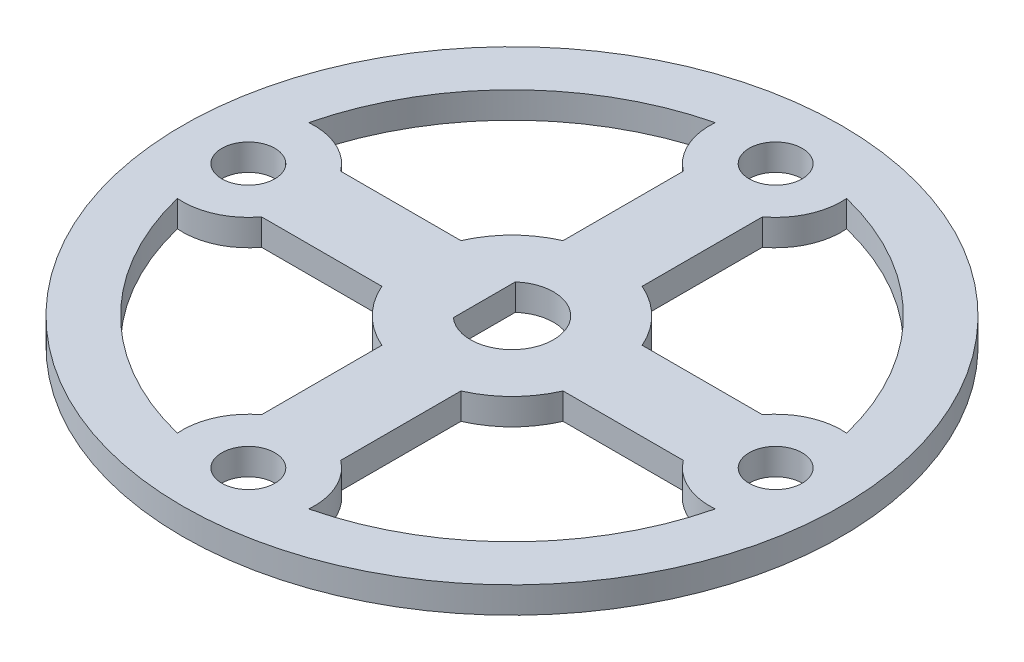
ISO-10303-21;
HEADER;
FILE_DESCRIPTION(('STEP AP214'),'2;1');
FILE_NAME('part.step','',(''),(''),'','','');
FILE_SCHEMA(('AUTOMOTIVE_DESIGN { 1 0 10303 214 1 1 1 1 }'));
ENDSEC;
DATA;
#1=APPLICATION_CONTEXT('core data for automotive mechanical design processes');
#2=APPLICATION_PROTOCOL_DEFINITION('international standard','automotive_design',2000,#1);
#3=PRODUCT_CONTEXT('',#1,'mechanical');
#4=PRODUCT('Part','Part','',(#3));
#5=PRODUCT_RELATED_PRODUCT_CATEGORY('part','',(#4));
#6=PRODUCT_DEFINITION_FORMATION('','',#4);
#7=PRODUCT_DEFINITION_CONTEXT('part definition',#1,'design');
#8=PRODUCT_DEFINITION('design','',#6,#7);
#9=PRODUCT_DEFINITION_SHAPE('','',#8);
#10=(LENGTH_UNIT() NAMED_UNIT(*) SI_UNIT(.MILLI.,.METRE.));
#11=(NAMED_UNIT(*) PLANE_ANGLE_UNIT() SI_UNIT($,.RADIAN.));
#12=(NAMED_UNIT(*) SI_UNIT($,.STERADIAN.) SOLID_ANGLE_UNIT());
#13=UNCERTAINTY_MEASURE_WITH_UNIT(LENGTH_MEASURE(1.E-05),#10,'distance_accuracy_value','');
#14=(GEOMETRIC_REPRESENTATION_CONTEXT(3) GLOBAL_UNCERTAINTY_ASSIGNED_CONTEXT((#13)) GLOBAL_UNIT_ASSIGNED_CONTEXT((#10,
#11,#12)) REPRESENTATION_CONTEXT('',''));
#15=CARTESIAN_POINT('',(0.,0.,0.));
#16=DIRECTION('',(0.,0.,1.));
#17=DIRECTION('',(1.,0.,0.));
#18=AXIS2_PLACEMENT_3D('',#15,#16,#17);
#19=CARTESIAN_POINT('',(0.,1.27,0.));
#20=DIRECTION('',(0.,1.,0.));
#21=DIRECTION('',(0.,0.,1.));
#22=AXIS2_PLACEMENT_3D('',#19,#20,#21);
#23=PLANE('',#22);
#24=CARTESIAN_POINT('',(-25.4,1.27,0.));
#25=DIRECTION('',(0.,-1.,0.));
#26=DIRECTION('',(-1.,0.,0.));
#27=AXIS2_PLACEMENT_3D('',#24,#25,#26);
#28=CIRCLE('',#27,6.35);
#29=CARTESIAN_POINT('',(-25.908,1.27,-6.32964738354348));
#30=VERTEX_POINT('',#29);
#31=CARTESIAN_POINT('',(-20.32,1.27,-3.80999999999993));
#32=VERTEX_POINT('',#31);
#33=EDGE_CURVE('E51',#30,#32,#28,.T.);
#34=ORIENTED_EDGE('',*,*,#33,.F.);
#35=CARTESIAN_POINT('',(0.,1.27,0.));
#36=DIRECTION('',(0.,1.,0.));
#37=DIRECTION('',(-1.,0.,0.));
#38=AXIS2_PLACEMENT_3D('',#35,#36,#37);
#39=CIRCLE('',#38,26.67);
#40=CARTESIAN_POINT('',(-6.32964738354366,1.27,-25.908));
#41=VERTEX_POINT('',#40);
#42=EDGE_CURVE('E231',#41,#30,#39,.T.);
#43=ORIENTED_EDGE('',*,*,#42,.F.);
#44=CARTESIAN_POINT('',(0.,1.27,-25.4));
#45=DIRECTION('',(0.,-1.,0.));
#46=DIRECTION('',(1.,0.,0.));
#47=AXIS2_PLACEMENT_3D('',#44,#45,#46);
#48=CIRCLE('',#47,6.35);
#49=CARTESIAN_POINT('',(-3.81000000000007,1.27,-20.32));
#50=VERTEX_POINT('',#49);
#51=EDGE_CURVE('E234',#50,#41,#48,.T.);
#52=ORIENTED_EDGE('',*,*,#51,.F.);
#53=DIRECTION('',(0.,0.,-1.));
#54=VECTOR('',#53,1.);
#55=CARTESIAN_POINT('',(-3.81000000000003,1.27,-8.72980669889086));
#56=LINE('',#55,#54);
#57=CARTESIAN_POINT('',(-3.81000000000003,1.27,-8.72980669889086));
#58=VERTEX_POINT('',#57);
#59=EDGE_CURVE('E251',#58,#50,#56,.T.);
#60=ORIENTED_EDGE('',*,*,#59,.F.);
#61=CARTESIAN_POINT('',(0.,1.27,0.));
#62=DIRECTION('',(0.,-1.,0.));
#63=DIRECTION('',(-1.,0.,0.));
#64=AXIS2_PLACEMENT_3D('',#61,#62,#63);
#65=CIRCLE('',#64,9.525);
#66=CARTESIAN_POINT('',(-8.72980669889089,1.27,-3.80999999999997));
#67=VERTEX_POINT('',#66);
#68=EDGE_CURVE('E248',#67,#58,#65,.T.);
#69=ORIENTED_EDGE('',*,*,#68,.F.);
#70=DIRECTION('',(1.,0.,0.));
#71=VECTOR('',#70,1.);
#72=CARTESIAN_POINT('',(-8.72980669889089,1.27,-3.80999999999997));
#73=LINE('',#72,#71);
#74=EDGE_CURVE('E245',#32,#67,#73,.T.);
#75=ORIENTED_EDGE('',*,*,#74,.F.);
#76=EDGE_LOOP('',(#34,#43,#52,#60,#69,#75));
#77=FACE_BOUND('',#76,.T.);
#78=CARTESIAN_POINT('',(0.,1.27,25.4));
#79=DIRECTION('',(0.,-1.,0.));
#80=DIRECTION('',(0.,0.,1.));
#81=AXIS2_PLACEMENT_3D('',#78,#79,#80);
#82=CIRCLE('',#81,6.35);
#83=CARTESIAN_POINT('',(-6.32964738354357,1.27,25.908));
#84=VERTEX_POINT('',#83);
#85=CARTESIAN_POINT('',(-3.81,1.27,20.32));
#86=VERTEX_POINT('',#85);
#87=EDGE_CURVE('E59',#84,#86,#82,.T.);
#88=ORIENTED_EDGE('',*,*,#87,.F.);
#89=CARTESIAN_POINT('',(0.,1.27,0.));
#90=DIRECTION('',(0.,1.,0.));
#91=DIRECTION('',(0.,0.,1.));
#92=AXIS2_PLACEMENT_3D('',#89,#90,#91);
#93=CIRCLE('',#92,26.67);
#94=CARTESIAN_POINT('',(-25.908,1.27,6.32964738354357));
#95=VERTEX_POINT('',#94);
#96=EDGE_CURVE('E270',#95,#84,#93,.T.);
#97=ORIENTED_EDGE('',*,*,#96,.F.);
#98=CARTESIAN_POINT('',(-25.4,1.27,0.));
#99=DIRECTION('',(0.,-1.,0.));
#100=DIRECTION('',(0.,0.,-1.));
#101=AXIS2_PLACEMENT_3D('',#98,#99,#100);
#102=CIRCLE('',#101,6.35);
#103=CARTESIAN_POINT('',(-20.32,1.27,3.81));
#104=VERTEX_POINT('',#103);
#105=EDGE_CURVE('E297',#104,#95,#102,.T.);
#106=ORIENTED_EDGE('',*,*,#105,.F.);
#107=DIRECTION('',(-1.,0.,0.));
#108=VECTOR('',#107,1.);
#109=CARTESIAN_POINT('',(-8.72980669889088,1.27,3.81));
#110=LINE('',#109,#108);
#111=CARTESIAN_POINT('',(-8.72980669889088,1.27,3.81));
#112=VERTEX_POINT('',#111);
#113=EDGE_CURVE('E294',#112,#104,#110,.T.);
#114=ORIENTED_EDGE('',*,*,#113,.F.);
#115=CARTESIAN_POINT('',(0.,1.27,0.));
#116=DIRECTION('',(0.,-1.,0.));
#117=DIRECTION('',(0.,0.,1.));
#118=AXIS2_PLACEMENT_3D('',#115,#116,#117);
#119=CIRCLE('',#118,9.525);
#120=CARTESIAN_POINT('',(-3.81,1.27,8.72980669889088));
#121=VERTEX_POINT('',#120);
#122=EDGE_CURVE('E291',#121,#112,#119,.T.);
#123=ORIENTED_EDGE('',*,*,#122,.F.);
#124=DIRECTION('',(0.,0.,-1.));
#125=VECTOR('',#124,1.);
#126=CARTESIAN_POINT('',(-3.81,1.27,8.72980669889088));
#127=LINE('',#126,#125);
#128=EDGE_CURVE('E287',#86,#121,#127,.T.);
#129=ORIENTED_EDGE('',*,*,#128,.F.);
#130=EDGE_LOOP('',(#88,#97,#106,#114,#123,#129));
#131=FACE_BOUND('',#130,.T.);
#132=CARTESIAN_POINT('',(25.4,1.27,-2.66050878019847E-13));
#133=DIRECTION('',(0.,-1.,0.));
#134=DIRECTION('',(1.,0.,0.));
#135=AXIS2_PLACEMENT_3D('',#132,#133,#134);
#136=CIRCLE('',#135,6.35);
#137=CARTESIAN_POINT('',(25.9080000000001,1.27,6.3296473835433));
#138=VERTEX_POINT('',#137);
#139=CARTESIAN_POINT('',(20.32,1.27,3.80999999999979));
#140=VERTEX_POINT('',#139);
#141=EDGE_CURVE('E332',#138,#140,#136,.T.);
#142=ORIENTED_EDGE('',*,*,#141,.F.);
#143=CARTESIAN_POINT('',(0.,1.27,0.));
#144=DIRECTION('',(0.,1.,0.));
#145=DIRECTION('',(1.,0.,0.));
#146=AXIS2_PLACEMENT_3D('',#143,#144,#145);
#147=CIRCLE('',#146,26.67);
#148=CARTESIAN_POINT('',(6.32964738354385,1.27,25.9079999999999));
#149=VERTEX_POINT('',#148);
#150=EDGE_CURVE('E316',#149,#138,#147,.T.);
#151=ORIENTED_EDGE('',*,*,#150,.F.);
#152=CARTESIAN_POINT('',(2.66050878019847E-13,1.27,25.4));
#153=DIRECTION('',(0.,-1.,0.));
#154=DIRECTION('',(-1.,0.,0.));
#155=AXIS2_PLACEMENT_3D('',#152,#153,#154);
#156=CIRCLE('',#155,6.35);
#157=CARTESIAN_POINT('',(3.81000000000021,1.27,20.32));
#158=VERTEX_POINT('',#157);
#159=EDGE_CURVE('E343',#158,#149,#156,.T.);
#160=ORIENTED_EDGE('',*,*,#159,.F.);
#161=DIRECTION('',(0.,0.,1.));
#162=VECTOR('',#161,1.);
#163=CARTESIAN_POINT('',(3.81000000000009,1.27,8.72980669889083));
#164=LINE('',#163,#162);
#165=CARTESIAN_POINT('',(3.81000000000009,1.27,8.72980669889083));
#166=VERTEX_POINT('',#165);
#167=EDGE_CURVE('E340',#166,#158,#164,.T.);
#168=ORIENTED_EDGE('',*,*,#167,.F.);
#169=CARTESIAN_POINT('',(0.,1.27,0.));
#170=DIRECTION('',(0.,-1.,0.));
#171=DIRECTION('',(1.,0.,0.));
#172=AXIS2_PLACEMENT_3D('',#169,#170,#171);
#173=CIRCLE('',#172,9.525);
#174=CARTESIAN_POINT('',(8.72980669889091,1.27,3.80999999999991));
#175=VERTEX_POINT('',#174);
#176=EDGE_CURVE('E337',#175,#166,#173,.T.);
#177=ORIENTED_EDGE('',*,*,#176,.F.);
#178=DIRECTION('',(-1.,0.,0.));
#179=VECTOR('',#178,1.);
#180=CARTESIAN_POINT('',(8.72980669889091,1.27,3.80999999999991));
#181=LINE('',#180,#179);
#182=EDGE_CURVE('E334',#140,#175,#181,.T.);
#183=ORIENTED_EDGE('',*,*,#182,.F.);
#184=EDGE_LOOP('',(#142,#151,#160,#168,#177,#183));
#185=FACE_BOUND('',#184,.T.);
#186=CARTESIAN_POINT('',(-25.4,1.27,0.));
#187=DIRECTION('',(0.,1.,0.));
#188=DIRECTION('',(1.,0.,0.));
#189=AXIS2_PLACEMENT_3D('',#186,#187,#188);
#190=CIRCLE('',#189,2.5527);
#191=CARTESIAN_POINT('',(-22.8473,1.27,0.));
#192=VERTEX_POINT('',#191);
#193=EDGE_CURVE('E363',#192,#192,#190,.T.);
#194=ORIENTED_EDGE('',*,*,#193,.F.);
#195=EDGE_LOOP('',(#194));
#196=FACE_BOUND('',#195,.T.);
#197=CARTESIAN_POINT('',(0.,1.27,25.4));
#198=DIRECTION('',(0.,1.,0.));
#199=DIRECTION('',(0.,0.,-1.));
#200=AXIS2_PLACEMENT_3D('',#197,#198,#199);
#201=CIRCLE('',#200,2.5527);
#202=CARTESIAN_POINT('',(0.,1.27,22.8473));
#203=VERTEX_POINT('',#202);
#204=EDGE_CURVE('E369',#203,#203,#201,.T.);
#205=ORIENTED_EDGE('',*,*,#204,.F.);
#206=EDGE_LOOP('',(#205));
#207=FACE_BOUND('',#206,.T.);
#208=CARTESIAN_POINT('',(25.4,1.27,-2.66050878019847E-13));
#209=DIRECTION('',(0.,1.,0.));
#210=DIRECTION('',(-1.,0.,0.));
#211=AXIS2_PLACEMENT_3D('',#208,#209,#210);
#212=CIRCLE('',#211,2.5527);
#213=CARTESIAN_POINT('',(22.8473,1.27,-2.39312764778852E-13));
#214=VERTEX_POINT('',#213);
#215=EDGE_CURVE('E258',#214,#214,#212,.T.);
#216=ORIENTED_EDGE('',*,*,#215,.F.);
#217=EDGE_LOOP('',(#216));
#218=FACE_BOUND('',#217,.T.);
#219=CARTESIAN_POINT('',(0.,1.27,-25.4));
#220=DIRECTION('',(0.,-1.,0.));
#221=DIRECTION('',(0.,0.,-1.));
#222=AXIS2_PLACEMENT_3D('',#219,#220,#221);
#223=CIRCLE('',#222,6.35);
#224=CARTESIAN_POINT('',(6.32964738354357,1.27,-25.908));
#225=VERTEX_POINT('',#224);
#226=CARTESIAN_POINT('',(3.81,1.27,-20.32));
#227=VERTEX_POINT('',#226);
#228=EDGE_CURVE('E362',#225,#227,#223,.T.);
#229=ORIENTED_EDGE('',*,*,#228,.F.);
#230=CARTESIAN_POINT('',(0.,1.27,0.));
#231=DIRECTION('',(0.,1.,0.));
#232=DIRECTION('',(0.,0.,-1.));
#233=AXIS2_PLACEMENT_3D('',#230,#231,#232);
#234=CIRCLE('',#233,26.67);
#235=CARTESIAN_POINT('',(25.908,1.27,-6.32964738354357));
#236=VERTEX_POINT('',#235);
#237=EDGE_CURVE('E381',#236,#225,#234,.T.);
#238=ORIENTED_EDGE('',*,*,#237,.F.);
#239=CARTESIAN_POINT('',(25.4,1.27,0.));
#240=DIRECTION('',(0.,-1.,0.));
#241=DIRECTION('',(0.,0.,1.));
#242=AXIS2_PLACEMENT_3D('',#239,#240,#241);
#243=CIRCLE('',#242,6.35);
#244=CARTESIAN_POINT('',(20.32,1.27,-3.81));
#245=VERTEX_POINT('',#244);
#246=EDGE_CURVE('E407',#245,#236,#243,.T.);
#247=ORIENTED_EDGE('',*,*,#246,.F.);
#248=DIRECTION('',(1.,0.,0.));
#249=VECTOR('',#248,1.);
#250=CARTESIAN_POINT('',(8.72980669889088,1.27,-3.81));
#251=LINE('',#250,#249);
#252=CARTESIAN_POINT('',(8.72980669889088,1.27,-3.81));
#253=VERTEX_POINT('',#252);
#254=EDGE_CURVE('E404',#253,#245,#251,.T.);
#255=ORIENTED_EDGE('',*,*,#254,.F.);
#256=CARTESIAN_POINT('',(0.,1.27,0.));
#257=DIRECTION('',(0.,-1.,0.));
#258=DIRECTION('',(0.,0.,-1.));
#259=AXIS2_PLACEMENT_3D('',#256,#257,#258);
#260=CIRCLE('',#259,9.525);
#261=CARTESIAN_POINT('',(3.81,1.27,-8.72980669889088));
#262=VERTEX_POINT('',#261);
#263=EDGE_CURVE('E401',#262,#253,#260,.T.);
#264=ORIENTED_EDGE('',*,*,#263,.F.);
#265=DIRECTION('',(0.,0.,1.));
#266=VECTOR('',#265,1.);
#267=CARTESIAN_POINT('',(3.81,1.27,-8.72980669889088));
#268=LINE('',#267,#266);
#269=EDGE_CURVE('E398',#227,#262,#268,.T.);
#270=ORIENTED_EDGE('',*,*,#269,.F.);
#271=EDGE_LOOP('',(#229,#238,#247,#255,#264,#270));
#272=FACE_BOUND('',#271,.T.);
#273=CARTESIAN_POINT('',(0.,1.27,-25.4));
#274=DIRECTION('',(0.,1.,0.));
#275=DIRECTION('',(0.,0.,1.));
#276=AXIS2_PLACEMENT_3D('',#273,#274,#275);
#277=CIRCLE('',#276,2.5527);
#278=CARTESIAN_POINT('',(0.,1.27,-22.8473));
#279=VERTEX_POINT('',#278);
#280=EDGE_CURVE('E414',#279,#279,#277,.T.);
#281=ORIENTED_EDGE('',*,*,#280,.F.);
#282=EDGE_LOOP('',(#281));
#283=FACE_BOUND('',#282,.T.);
#284=CARTESIAN_POINT('',(0.,1.27,0.));
#285=DIRECTION('',(0.,1.,0.));
#286=DIRECTION('',(0.,0.,1.));
#287=AXIS2_PLACEMENT_3D('',#284,#285,#286);
#288=CIRCLE('',#287,31.75);
#289=CARTESIAN_POINT('',(0.,1.27,31.75));
#290=VERTEX_POINT('',#289);
#291=EDGE_CURVE('E11',#290,#290,#288,.T.);
#292=ORIENTED_EDGE('',*,*,#291,.T.);
#293=EDGE_LOOP('',(#292));
#294=FACE_BOUND('',#293,.T.);
#295=CARTESIAN_POINT('',(0.,1.27,0.));
#296=DIRECTION('',(0.,1.,0.));
#297=DIRECTION('',(0.,0.,1.));
#298=AXIS2_PLACEMENT_3D('',#295,#296,#297);
#299=CIRCLE('',#298,4.000000128);
#300=CARTESIAN_POINT('',(-2.667,1.27,2.98112596580554));
#301=VERTEX_POINT('',#300);
#302=CARTESIAN_POINT('',(-2.667,1.27,-2.98112596580554));
#303=VERTEX_POINT('',#302);
#304=EDGE_CURVE('E443',#301,#303,#299,.T.);
#305=ORIENTED_EDGE('',*,*,#304,.F.);
#306=DIRECTION('',(0.,0.,-1.));
#307=VECTOR('',#306,1.);
#308=CARTESIAN_POINT('',(-2.667,1.27,2.98112596580554));
#309=LINE('',#308,#307);
#310=EDGE_CURVE('E428',#301,#303,#309,.T.);
#311=ORIENTED_EDGE('',*,*,#310,.T.);
#312=EDGE_LOOP('',(#305,#311));
#313=FACE_BOUND('',#312,.T.);
#314=ADVANCED_FACE('F36',(#77,#131,#185,#196,#207,#218,#272,#283,#294,#313),#23,.T.);
#315=CARTESIAN_POINT('',(0.,-1.27,0.));
#316=DIRECTION('',(0.,1.,0.));
#317=DIRECTION('',(0.,0.,1.));
#318=AXIS2_PLACEMENT_3D('',#315,#316,#317);
#319=PLANE('',#318);
#320=CARTESIAN_POINT('',(0.,-1.27,0.));
#321=DIRECTION('',(0.,1.,0.));
#322=DIRECTION('',(-1.,0.,0.));
#323=AXIS2_PLACEMENT_3D('',#320,#321,#322);
#324=CIRCLE('',#323,26.67);
#325=CARTESIAN_POINT('',(-6.32964738354366,-1.27,-25.908));
#326=VERTEX_POINT('',#325);
#327=CARTESIAN_POINT('',(-25.908,-1.27,-6.32964738354348));
#328=VERTEX_POINT('',#327);
#329=EDGE_CURVE('E217',#326,#328,#324,.T.);
#330=ORIENTED_EDGE('',*,*,#329,.T.);
#331=CARTESIAN_POINT('',(-25.4,-1.27,0.));
#332=DIRECTION('',(0.,-1.,0.));
#333=DIRECTION('',(-1.,0.,0.));
#334=AXIS2_PLACEMENT_3D('',#331,#332,#333);
#335=CIRCLE('',#334,6.35);
#336=CARTESIAN_POINT('',(-20.32,-1.27,-3.80999999999993));
#337=VERTEX_POINT('',#336);
#338=EDGE_CURVE('E211',#328,#337,#335,.T.);
#339=ORIENTED_EDGE('',*,*,#338,.T.);
#340=DIRECTION('',(1.,0.,0.));
#341=VECTOR('',#340,1.);
#342=CARTESIAN_POINT('',(-8.72980669889089,-1.27,-3.80999999999997));
#343=LINE('',#342,#341);
#344=CARTESIAN_POINT('',(-8.72980669889089,-1.27,-3.80999999999997));
#345=VERTEX_POINT('',#344);
#346=EDGE_CURVE('E221',#337,#345,#343,.T.);
#347=ORIENTED_EDGE('',*,*,#346,.T.);
#348=CARTESIAN_POINT('',(0.,-1.27,0.));
#349=DIRECTION('',(0.,-1.,0.));
#350=DIRECTION('',(-1.,0.,0.));
#351=AXIS2_PLACEMENT_3D('',#348,#349,#350);
#352=CIRCLE('',#351,9.525);
#353=CARTESIAN_POINT('',(-3.81000000000003,-1.27,-8.72980669889086));
#354=VERTEX_POINT('',#353);
#355=EDGE_CURVE('E225',#345,#354,#352,.T.);
#356=ORIENTED_EDGE('',*,*,#355,.T.);
#357=DIRECTION('',(0.,0.,-1.));
#358=VECTOR('',#357,1.);
#359=CARTESIAN_POINT('',(-3.81000000000003,-1.27,-8.72980669889086));
#360=LINE('',#359,#358);
#361=CARTESIAN_POINT('',(-3.81000000000007,-1.27,-20.32));
#362=VERTEX_POINT('',#361);
#363=EDGE_CURVE('E238',#354,#362,#360,.T.);
#364=ORIENTED_EDGE('',*,*,#363,.T.);
#365=CARTESIAN_POINT('',(0.,-1.27,-25.4));
#366=DIRECTION('',(0.,-1.,0.));
#367=DIRECTION('',(1.,0.,0.));
#368=AXIS2_PLACEMENT_3D('',#365,#366,#367);
#369=CIRCLE('',#368,6.35);
#370=EDGE_CURVE('E241',#362,#326,#369,.T.);
#371=ORIENTED_EDGE('',*,*,#370,.T.);
#372=EDGE_LOOP('',(#330,#339,#347,#356,#364,#371));
#373=FACE_BOUND('',#372,.T.);
#374=CARTESIAN_POINT('',(0.,-1.27,0.));
#375=DIRECTION('',(0.,1.,0.));
#376=DIRECTION('',(0.,0.,1.));
#377=AXIS2_PLACEMENT_3D('',#374,#375,#376);
#378=CIRCLE('',#377,26.67);
#379=CARTESIAN_POINT('',(-25.908,-1.27,6.32964738354357));
#380=VERTEX_POINT('',#379);
#381=CARTESIAN_POINT('',(-6.32964738354357,-1.27,25.908));
#382=VERTEX_POINT('',#381);
#383=EDGE_CURVE('E282',#380,#382,#378,.T.);
#384=ORIENTED_EDGE('',*,*,#383,.T.);
#385=CARTESIAN_POINT('',(0.,-1.27,25.4));
#386=DIRECTION('',(0.,-1.,0.));
#387=DIRECTION('',(0.,0.,1.));
#388=AXIS2_PLACEMENT_3D('',#385,#386,#387);
#389=CIRCLE('',#388,6.35);
#390=CARTESIAN_POINT('',(-3.81,-1.27,20.32));
#391=VERTEX_POINT('',#390);
#392=EDGE_CURVE('E266',#382,#391,#389,.T.);
#393=ORIENTED_EDGE('',*,*,#392,.T.);
#394=DIRECTION('',(0.,0.,-1.));
#395=VECTOR('',#394,1.);
#396=CARTESIAN_POINT('',(-3.81,-1.27,8.72980669889088));
#397=LINE('',#396,#395);
#398=CARTESIAN_POINT('',(-3.81,-1.27,8.72980669889088));
#399=VERTEX_POINT('',#398);
#400=EDGE_CURVE('E269',#391,#399,#397,.T.);
#401=ORIENTED_EDGE('',*,*,#400,.T.);
#402=CARTESIAN_POINT('',(0.,-1.27,0.));
#403=DIRECTION('',(0.,-1.,0.));
#404=DIRECTION('',(0.,0.,1.));
#405=AXIS2_PLACEMENT_3D('',#402,#403,#404);
#406=CIRCLE('',#405,9.525);
#407=CARTESIAN_POINT('',(-8.72980669889088,-1.27,3.81));
#408=VERTEX_POINT('',#407);
#409=EDGE_CURVE('E273',#399,#408,#406,.T.);
#410=ORIENTED_EDGE('',*,*,#409,.T.);
#411=DIRECTION('',(-1.,0.,0.));
#412=VECTOR('',#411,1.);
#413=CARTESIAN_POINT('',(-8.72980669889088,-1.27,3.81));
#414=LINE('',#413,#412);
#415=CARTESIAN_POINT('',(-20.32,-1.27,3.81));
#416=VERTEX_POINT('',#415);
#417=EDGE_CURVE('E276',#408,#416,#414,.T.);
#418=ORIENTED_EDGE('',*,*,#417,.T.);
#419=CARTESIAN_POINT('',(-25.4,-1.27,0.));
#420=DIRECTION('',(0.,-1.,0.));
#421=DIRECTION('',(0.,0.,-1.));
#422=AXIS2_PLACEMENT_3D('',#419,#420,#421);
#423=CIRCLE('',#422,6.35);
#424=EDGE_CURVE('E279',#416,#380,#423,.T.);
#425=ORIENTED_EDGE('',*,*,#424,.T.);
#426=EDGE_LOOP('',(#384,#393,#401,#410,#418,#425));
#427=FACE_BOUND('',#426,.T.);
#428=CARTESIAN_POINT('',(0.,-1.27,0.));
#429=DIRECTION('',(0.,1.,0.));
#430=DIRECTION('',(1.,0.,0.));
#431=AXIS2_PLACEMENT_3D('',#428,#429,#430);
#432=CIRCLE('',#431,26.67);
#433=CARTESIAN_POINT('',(6.32964738354385,-1.27,25.9079999999999));
#434=VERTEX_POINT('',#433);
#435=CARTESIAN_POINT('',(25.9080000000001,-1.27,6.3296473835433));
#436=VERTEX_POINT('',#435);
#437=EDGE_CURVE('E328',#434,#436,#432,.T.);
#438=ORIENTED_EDGE('',*,*,#437,.T.);
#439=CARTESIAN_POINT('',(25.4,-1.27,-2.66050878019847E-13));
#440=DIRECTION('',(0.,-1.,0.));
#441=DIRECTION('',(1.,0.,0.));
#442=AXIS2_PLACEMENT_3D('',#439,#440,#441);
#443=CIRCLE('',#442,6.35);
#444=CARTESIAN_POINT('',(20.32,-1.27,3.80999999999979));
#445=VERTEX_POINT('',#444);
#446=EDGE_CURVE('E312',#436,#445,#443,.T.);
#447=ORIENTED_EDGE('',*,*,#446,.T.);
#448=DIRECTION('',(-1.,0.,0.));
#449=VECTOR('',#448,1.);
#450=CARTESIAN_POINT('',(8.72980669889091,-1.27,3.80999999999991));
#451=LINE('',#450,#449);
#452=CARTESIAN_POINT('',(8.72980669889091,-1.27,3.80999999999991));
#453=VERTEX_POINT('',#452);
#454=EDGE_CURVE('E315',#445,#453,#451,.T.);
#455=ORIENTED_EDGE('',*,*,#454,.T.);
#456=CARTESIAN_POINT('',(0.,-1.27,0.));
#457=DIRECTION('',(0.,-1.,0.));
#458=DIRECTION('',(1.,0.,0.));
#459=AXIS2_PLACEMENT_3D('',#456,#457,#458);
#460=CIRCLE('',#459,9.525);
#461=CARTESIAN_POINT('',(3.81000000000009,-1.27,8.72980669889083));
#462=VERTEX_POINT('',#461);
#463=EDGE_CURVE('E319',#453,#462,#460,.T.);
#464=ORIENTED_EDGE('',*,*,#463,.T.);
#465=DIRECTION('',(0.,0.,1.));
#466=VECTOR('',#465,1.);
#467=CARTESIAN_POINT('',(3.81000000000009,-1.27,8.72980669889083));
#468=LINE('',#467,#466);
#469=CARTESIAN_POINT('',(3.81000000000021,-1.27,20.32));
#470=VERTEX_POINT('',#469);
#471=EDGE_CURVE('E322',#462,#470,#468,.T.);
#472=ORIENTED_EDGE('',*,*,#471,.T.);
#473=CARTESIAN_POINT('',(2.66050878019847E-13,-1.27,25.4));
#474=DIRECTION('',(0.,-1.,0.));
#475=DIRECTION('',(-1.,0.,0.));
#476=AXIS2_PLACEMENT_3D('',#473,#474,#475);
#477=CIRCLE('',#476,6.35);
#478=EDGE_CURVE('E325',#470,#434,#477,.T.);
#479=ORIENTED_EDGE('',*,*,#478,.T.);
#480=EDGE_LOOP('',(#438,#447,#455,#464,#472,#479));
#481=FACE_BOUND('',#480,.T.);
#482=CARTESIAN_POINT('',(-25.4,-1.27,0.));
#483=DIRECTION('',(0.,1.,0.));
#484=DIRECTION('',(1.,0.,0.));
#485=AXIS2_PLACEMENT_3D('',#482,#483,#484);
#486=CIRCLE('',#485,2.5527);
#487=CARTESIAN_POINT('',(-22.8473,-1.27,0.));
#488=VERTEX_POINT('',#487);
#489=EDGE_CURVE('E359',#488,#488,#486,.T.);
#490=ORIENTED_EDGE('',*,*,#489,.T.);
#491=EDGE_LOOP('',(#490));
#492=FACE_BOUND('',#491,.T.);
#493=CARTESIAN_POINT('',(0.,-1.27,25.4));
#494=DIRECTION('',(0.,1.,0.));
#495=DIRECTION('',(0.,0.,-1.));
#496=AXIS2_PLACEMENT_3D('',#493,#494,#495);
#497=CIRCLE('',#496,2.5527);
#498=CARTESIAN_POINT('',(0.,-1.27,22.8473));
#499=VERTEX_POINT('',#498);
#500=EDGE_CURVE('E366',#499,#499,#497,.T.);
#501=ORIENTED_EDGE('',*,*,#500,.T.);
#502=EDGE_LOOP('',(#501));
#503=FACE_BOUND('',#502,.T.);
#504=CARTESIAN_POINT('',(25.4,-1.27,-2.66050878019847E-13));
#505=DIRECTION('',(0.,1.,0.));
#506=DIRECTION('',(-1.,0.,0.));
#507=AXIS2_PLACEMENT_3D('',#504,#505,#506);
#508=CIRCLE('',#507,2.5527);
#509=CARTESIAN_POINT('',(22.8473,-1.27,-2.39312764778852E-13));
#510=VERTEX_POINT('',#509);
#511=EDGE_CURVE('E372',#510,#510,#508,.T.);
#512=ORIENTED_EDGE('',*,*,#511,.T.);
#513=EDGE_LOOP('',(#512));
#514=FACE_BOUND('',#513,.T.);
#515=CARTESIAN_POINT('',(0.,-1.27,0.));
#516=DIRECTION('',(0.,1.,0.));
#517=DIRECTION('',(0.,0.,-1.));
#518=AXIS2_PLACEMENT_3D('',#515,#516,#517);
#519=CIRCLE('',#518,26.67);
#520=CARTESIAN_POINT('',(25.908,-1.27,-6.32964738354357));
#521=VERTEX_POINT('',#520);
#522=CARTESIAN_POINT('',(6.32964738354357,-1.27,-25.908));
#523=VERTEX_POINT('',#522);
#524=EDGE_CURVE('E393',#521,#523,#519,.T.);
#525=ORIENTED_EDGE('',*,*,#524,.T.);
#526=CARTESIAN_POINT('',(0.,-1.27,-25.4));
#527=DIRECTION('',(0.,-1.,0.));
#528=DIRECTION('',(0.,0.,-1.));
#529=AXIS2_PLACEMENT_3D('',#526,#527,#528);
#530=CIRCLE('',#529,6.35);
#531=CARTESIAN_POINT('',(3.81,-1.27,-20.32));
#532=VERTEX_POINT('',#531);
#533=EDGE_CURVE('E377',#523,#532,#530,.T.);
#534=ORIENTED_EDGE('',*,*,#533,.T.);
#535=DIRECTION('',(0.,0.,1.));
#536=VECTOR('',#535,1.);
#537=CARTESIAN_POINT('',(3.81,-1.27,-8.72980669889088));
#538=LINE('',#537,#536);
#539=CARTESIAN_POINT('',(3.81,-1.27,-8.72980669889088));
#540=VERTEX_POINT('',#539);
#541=EDGE_CURVE('E380',#532,#540,#538,.T.);
#542=ORIENTED_EDGE('',*,*,#541,.T.);
#543=CARTESIAN_POINT('',(0.,-1.27,0.));
#544=DIRECTION('',(0.,-1.,0.));
#545=DIRECTION('',(0.,0.,-1.));
#546=AXIS2_PLACEMENT_3D('',#543,#544,#545);
#547=CIRCLE('',#546,9.525);
#548=CARTESIAN_POINT('',(8.72980669889088,-1.27,-3.81));
#549=VERTEX_POINT('',#548);
#550=EDGE_CURVE('E384',#540,#549,#547,.T.);
#551=ORIENTED_EDGE('',*,*,#550,.T.);
#552=DIRECTION('',(1.,0.,0.));
#553=VECTOR('',#552,1.);
#554=CARTESIAN_POINT('',(8.72980669889088,-1.27,-3.81));
#555=LINE('',#554,#553);
#556=CARTESIAN_POINT('',(20.32,-1.27,-3.81));
#557=VERTEX_POINT('',#556);
#558=EDGE_CURVE('E387',#549,#557,#555,.T.);
#559=ORIENTED_EDGE('',*,*,#558,.T.);
#560=CARTESIAN_POINT('',(25.4,-1.27,0.));
#561=DIRECTION('',(0.,-1.,0.));
#562=DIRECTION('',(0.,0.,1.));
#563=AXIS2_PLACEMENT_3D('',#560,#561,#562);
#564=CIRCLE('',#563,6.35);
#565=EDGE_CURVE('E390',#557,#521,#564,.T.);
#566=ORIENTED_EDGE('',*,*,#565,.T.);
#567=EDGE_LOOP('',(#525,#534,#542,#551,#559,#566));
#568=FACE_BOUND('',#567,.T.);
#569=CARTESIAN_POINT('',(0.,-1.27,-25.4));
#570=DIRECTION('',(0.,1.,0.));
#571=DIRECTION('',(0.,0.,1.));
#572=AXIS2_PLACEMENT_3D('',#569,#570,#571);
#573=CIRCLE('',#572,2.5527);
#574=CARTESIAN_POINT('',(0.,-1.27,-22.8473));
#575=VERTEX_POINT('',#574);
#576=EDGE_CURVE('E425',#575,#575,#573,.T.);
#577=ORIENTED_EDGE('',*,*,#576,.T.);
#578=EDGE_LOOP('',(#577));
#579=FACE_BOUND('',#578,.T.);
#580=CARTESIAN_POINT('',(0.,-1.27,0.));
#581=DIRECTION('',(0.,1.,0.));
#582=DIRECTION('',(0.,0.,1.));
#583=AXIS2_PLACEMENT_3D('',#580,#581,#582);
#584=CIRCLE('',#583,31.75);
#585=CARTESIAN_POINT('',(0.,-1.27,31.75));
#586=VERTEX_POINT('',#585);
#587=EDGE_CURVE('E40',#586,#586,#584,.T.);
#588=ORIENTED_EDGE('',*,*,#587,.F.);
#589=EDGE_LOOP('',(#588));
#590=FACE_BOUND('',#589,.T.);
#591=CARTESIAN_POINT('',(0.,-1.27,0.));
#592=DIRECTION('',(0.,1.,0.));
#593=DIRECTION('',(0.,0.,1.));
#594=AXIS2_PLACEMENT_3D('',#591,#592,#593);
#595=CIRCLE('',#594,4.000000128);
#596=CARTESIAN_POINT('',(-2.667,-1.27,2.98112596580554));
#597=VERTEX_POINT('',#596);
#598=CARTESIAN_POINT('',(-2.667,-1.27,-2.98112596580554));
#599=VERTEX_POINT('',#598);
#600=EDGE_CURVE('E440',#597,#599,#595,.T.);
#601=ORIENTED_EDGE('',*,*,#600,.T.);
#602=DIRECTION('',(0.,0.,-1.));
#603=VECTOR('',#602,1.);
#604=CARTESIAN_POINT('',(-2.667,-1.27,2.98112596580554));
#605=LINE('',#604,#603);
#606=EDGE_CURVE('E431',#597,#599,#605,.T.);
#607=ORIENTED_EDGE('',*,*,#606,.F.);
#608=EDGE_LOOP('',(#601,#607));
#609=FACE_BOUND('',#608,.T.);
#610=ADVANCED_FACE('F227',(#373,#427,#481,#492,#503,#514,#568,#579,#590,#609),#319,.F.);
#611=CARTESIAN_POINT('',(0.,1.27,0.));
#612=DIRECTION('',(0.,-1.,0.));
#613=DIRECTION('',(0.,0.,-1.));
#614=AXIS2_PLACEMENT_3D('',#611,#612,#613);
#615=CYLINDRICAL_SURFACE('',#614,31.75);
#616=ORIENTED_EDGE('',*,*,#291,.F.);
#617=EDGE_LOOP('',(#616));
#618=FACE_BOUND('',#617,.T.);
#619=ORIENTED_EDGE('',*,*,#587,.T.);
#620=EDGE_LOOP('',(#619));
#621=FACE_BOUND('',#620,.T.);
#622=ADVANCED_FACE('F38',(#618,#621),#615,.T.);
#623=CARTESIAN_POINT('',(0.,1.27,0.));
#624=DIRECTION('',(0.,-1.,0.));
#625=DIRECTION('',(0.,0.,-1.));
#626=AXIS2_PLACEMENT_3D('',#623,#624,#625);
#627=CYLINDRICAL_SURFACE('',#626,4.000000128);
#628=DIRECTION('',(0.,1.,0.));
#629=VECTOR('',#628,1.);
#630=CARTESIAN_POINT('',(-2.667,-1.27,2.98112596580554));
#631=LINE('',#630,#629);
#632=EDGE_CURVE('E434',#597,#301,#631,.T.);
#633=ORIENTED_EDGE('',*,*,#632,.T.);
#634=ORIENTED_EDGE('',*,*,#304,.T.);
#635=DIRECTION('',(0.,1.,0.));
#636=VECTOR('',#635,1.);
#637=CARTESIAN_POINT('',(-2.667,-1.27,-2.98112596580554));
#638=LINE('',#637,#636);
#639=EDGE_CURVE('E437',#599,#303,#638,.T.);
#640=ORIENTED_EDGE('',*,*,#639,.F.);
#641=ORIENTED_EDGE('',*,*,#600,.F.);
#642=EDGE_LOOP('',(#633,#634,#640,#641));
#643=FACE_BOUND('',#642,.T.);
#644=ADVANCED_FACE('F453',(#643),#627,.F.);
#645=CARTESIAN_POINT('',(-2.667,-1.27,2.98112596580554));
#646=DIRECTION('',(1.,0.,0.));
#647=DIRECTION('',(0.,0.,-1.));
#648=AXIS2_PLACEMENT_3D('',#645,#646,#647);
#649=PLANE('',#648);
#650=ORIENTED_EDGE('',*,*,#310,.F.);
#651=ORIENTED_EDGE('',*,*,#632,.F.);
#652=ORIENTED_EDGE('',*,*,#606,.T.);
#653=ORIENTED_EDGE('',*,*,#639,.T.);
#654=EDGE_LOOP('',(#650,#651,#652,#653));
#655=FACE_BOUND('',#654,.T.);
#656=ADVANCED_FACE('F452',(#655),#649,.T.);
#657=CARTESIAN_POINT('',(0.,-1.27,-25.4));
#658=DIRECTION('',(0.,1.,0.));
#659=DIRECTION('',(0.,0.,1.));
#660=AXIS2_PLACEMENT_3D('',#657,#658,#659);
#661=CYLINDRICAL_SURFACE('',#660,2.5527);
#662=ORIENTED_EDGE('',*,*,#576,.F.);
#663=EDGE_LOOP('',(#662));
#664=FACE_BOUND('',#663,.T.);
#665=ORIENTED_EDGE('',*,*,#280,.T.);
#666=EDGE_LOOP('',(#665));
#667=FACE_BOUND('',#666,.T.);
#668=ADVANCED_FACE('F467',(#664,#667),#661,.F.);
#669=CARTESIAN_POINT('',(0.,-1.27,-25.4));
#670=DIRECTION('',(0.,1.,0.));
#671=DIRECTION('',(0.,0.,1.));
#672=AXIS2_PLACEMENT_3D('',#669,#670,#671);
#673=CYLINDRICAL_SURFACE('',#672,6.35);
#674=ORIENTED_EDGE('',*,*,#228,.T.);
#675=DIRECTION('',(0.,1.,0.));
#676=VECTOR('',#675,1.);
#677=CARTESIAN_POINT('',(3.81,-1.27,-20.32));
#678=LINE('',#677,#676);
#679=EDGE_CURVE('E396',#532,#227,#678,.T.);
#680=ORIENTED_EDGE('',*,*,#679,.F.);
#681=ORIENTED_EDGE('',*,*,#533,.F.);
#682=DIRECTION('',(0.,1.,0.));
#683=VECTOR('',#682,1.);
#684=CARTESIAN_POINT('',(6.32964738354357,-1.27,-25.908));
#685=LINE('',#684,#683);
#686=EDGE_CURVE('E412',#523,#225,#685,.T.);
#687=ORIENTED_EDGE('',*,*,#686,.T.);
#688=EDGE_LOOP('',(#674,#680,#681,#687));
#689=FACE_BOUND('',#688,.T.);
#690=ADVANCED_FACE('F470',(#689),#673,.T.);
#691=CARTESIAN_POINT('',(0.,-1.27,0.));
#692=DIRECTION('',(0.,1.,0.));
#693=DIRECTION('',(0.,0.,1.));
#694=AXIS2_PLACEMENT_3D('',#691,#692,#693);
#695=CYLINDRICAL_SURFACE('',#694,26.67);
#696=ORIENTED_EDGE('',*,*,#237,.T.);
#697=ORIENTED_EDGE('',*,*,#686,.F.);
#698=ORIENTED_EDGE('',*,*,#524,.F.);
#699=DIRECTION('',(0.,1.,0.));
#700=VECTOR('',#699,1.);
#701=CARTESIAN_POINT('',(25.908,-1.27,-6.32964738354357));
#702=LINE('',#701,#700);
#703=EDGE_CURVE('E415',#521,#236,#702,.T.);
#704=ORIENTED_EDGE('',*,*,#703,.T.);
#705=EDGE_LOOP('',(#696,#697,#698,#704));
#706=FACE_BOUND('',#705,.T.);
#707=ADVANCED_FACE('F474',(#706),#695,.F.);
#708=CARTESIAN_POINT('',(25.4,-1.27,0.));
#709=DIRECTION('',(0.,1.,0.));
#710=DIRECTION('',(0.,0.,1.));
#711=AXIS2_PLACEMENT_3D('',#708,#709,#710);
#712=CYLINDRICAL_SURFACE('',#711,6.35);
#713=ORIENTED_EDGE('',*,*,#246,.T.);
#714=ORIENTED_EDGE('',*,*,#703,.F.);
#715=ORIENTED_EDGE('',*,*,#565,.F.);
#716=DIRECTION('',(0.,1.,0.));
#717=VECTOR('',#716,1.);
#718=CARTESIAN_POINT('',(20.32,-1.27,-3.81));
#719=LINE('',#718,#717);
#720=EDGE_CURVE('E417',#557,#245,#719,.T.);
#721=ORIENTED_EDGE('',*,*,#720,.T.);
#722=EDGE_LOOP('',(#713,#714,#715,#721));
#723=FACE_BOUND('',#722,.T.);
#724=ADVANCED_FACE('F488',(#723),#712,.T.);
#725=CARTESIAN_POINT('',(8.72980669889088,-1.27,-3.81));
#726=DIRECTION('',(0.,0.,1.));
#727=DIRECTION('',(1.,0.,0.));
#728=AXIS2_PLACEMENT_3D('',#725,#726,#727);
#729=PLANE('',#728);
#730=ORIENTED_EDGE('',*,*,#254,.T.);
#731=ORIENTED_EDGE('',*,*,#720,.F.);
#732=ORIENTED_EDGE('',*,*,#558,.F.);
#733=DIRECTION('',(0.,1.,0.));
#734=VECTOR('',#733,1.);
#735=CARTESIAN_POINT('',(8.72980669889088,-1.27,-3.81));
#736=LINE('',#735,#734);
#737=EDGE_CURVE('E419',#549,#253,#736,.T.);
#738=ORIENTED_EDGE('',*,*,#737,.T.);
#739=EDGE_LOOP('',(#730,#731,#732,#738));
#740=FACE_BOUND('',#739,.T.);
#741=ADVANCED_FACE('F484',(#740),#729,.F.);
#742=CARTESIAN_POINT('',(0.,-1.27,0.));
#743=DIRECTION('',(0.,1.,0.));
#744=DIRECTION('',(0.,0.,1.));
#745=AXIS2_PLACEMENT_3D('',#742,#743,#744);
#746=CYLINDRICAL_SURFACE('',#745,9.525);
#747=ORIENTED_EDGE('',*,*,#263,.T.);
#748=ORIENTED_EDGE('',*,*,#737,.F.);
#749=ORIENTED_EDGE('',*,*,#550,.F.);
#750=DIRECTION('',(0.,1.,0.));
#751=VECTOR('',#750,1.);
#752=CARTESIAN_POINT('',(3.81,-1.27,-8.72980669889088));
#753=LINE('',#752,#751);
#754=EDGE_CURVE('E421',#540,#262,#753,.T.);
#755=ORIENTED_EDGE('',*,*,#754,.T.);
#756=EDGE_LOOP('',(#747,#748,#749,#755));
#757=FACE_BOUND('',#756,.T.);
#758=ADVANCED_FACE('F480',(#757),#746,.T.);
#759=CARTESIAN_POINT('',(3.81,-1.27,-8.72980669889088));
#760=DIRECTION('',(-1.,0.,0.));
#761=DIRECTION('',(0.,0.,1.));
#762=AXIS2_PLACEMENT_3D('',#759,#760,#761);
#763=PLANE('',#762);
#764=ORIENTED_EDGE('',*,*,#269,.T.);
#765=ORIENTED_EDGE('',*,*,#754,.F.);
#766=ORIENTED_EDGE('',*,*,#541,.F.);
#767=ORIENTED_EDGE('',*,*,#679,.T.);
#768=EDGE_LOOP('',(#764,#765,#766,#767));
#769=FACE_BOUND('',#768,.T.);
#770=ADVANCED_FACE('F476',(#769),#763,.F.);
#771=CARTESIAN_POINT('',(25.4,-1.27,-2.66050878019847E-13));
#772=DIRECTION('',(0.,1.,0.));
#773=DIRECTION('',(0.,0.,1.));
#774=AXIS2_PLACEMENT_3D('',#771,#772,#773);
#775=CYLINDRICAL_SURFACE('',#774,2.5527);
#776=ORIENTED_EDGE('',*,*,#511,.F.);
#777=EDGE_LOOP('',(#776));
#778=FACE_BOUND('',#777,.T.);
#779=ORIENTED_EDGE('',*,*,#215,.T.);
#780=EDGE_LOOP('',(#779));
#781=FACE_BOUND('',#780,.T.);
#782=ADVANCED_FACE('F479',(#778,#781),#775,.F.);
#783=CARTESIAN_POINT('',(0.,-1.27,25.4));
#784=DIRECTION('',(0.,1.,0.));
#785=DIRECTION('',(0.,0.,1.));
#786=AXIS2_PLACEMENT_3D('',#783,#784,#785);
#787=CYLINDRICAL_SURFACE('',#786,2.5527);
#788=ORIENTED_EDGE('',*,*,#500,.F.);
#789=EDGE_LOOP('',(#788));
#790=FACE_BOUND('',#789,.T.);
#791=ORIENTED_EDGE('',*,*,#204,.T.);
#792=EDGE_LOOP('',(#791));
#793=FACE_BOUND('',#792,.T.);
#794=ADVANCED_FACE('F498',(#790,#793),#787,.F.);
#795=CARTESIAN_POINT('',(-25.4,-1.27,0.));
#796=DIRECTION('',(0.,1.,0.));
#797=DIRECTION('',(0.,0.,1.));
#798=AXIS2_PLACEMENT_3D('',#795,#796,#797);
#799=CYLINDRICAL_SURFACE('',#798,2.5527);
#800=ORIENTED_EDGE('',*,*,#489,.F.);
#801=EDGE_LOOP('',(#800));
#802=FACE_BOUND('',#801,.T.);
#803=ORIENTED_EDGE('',*,*,#193,.T.);
#804=EDGE_LOOP('',(#803));
#805=FACE_BOUND('',#804,.T.);
#806=ADVANCED_FACE('F502',(#802,#805),#799,.F.);
#807=CARTESIAN_POINT('',(25.4,-1.27,-2.66050878019847E-13));
#808=DIRECTION('',(0.,1.,0.));
#809=DIRECTION('',(0.,0.,1.));
#810=AXIS2_PLACEMENT_3D('',#807,#808,#809);
#811=CYLINDRICAL_SURFACE('',#810,6.35);
#812=ORIENTED_EDGE('',*,*,#141,.T.);
#813=DIRECTION('',(0.,1.,0.));
#814=VECTOR('',#813,1.);
#815=CARTESIAN_POINT('',(20.32,-1.27,3.80999999999979));
#816=LINE('',#815,#814);
#817=EDGE_CURVE('E331',#445,#140,#816,.T.);
#818=ORIENTED_EDGE('',*,*,#817,.F.);
#819=ORIENTED_EDGE('',*,*,#446,.F.);
#820=DIRECTION('',(0.,1.,0.));
#821=VECTOR('',#820,1.);
#822=CARTESIAN_POINT('',(25.9080000000001,-1.27,6.3296473835433));
#823=LINE('',#822,#821);
#824=EDGE_CURVE('E288',#436,#138,#823,.T.);
#825=ORIENTED_EDGE('',*,*,#824,.T.);
#826=EDGE_LOOP('',(#812,#818,#819,#825));
#827=FACE_BOUND('',#826,.T.);
#828=ADVANCED_FACE('F506',(#827),#811,.T.);
#829=CARTESIAN_POINT('',(0.,-1.27,0.));
#830=DIRECTION('',(0.,1.,0.));
#831=DIRECTION('',(0.,0.,1.));
#832=AXIS2_PLACEMENT_3D('',#829,#830,#831);
#833=CYLINDRICAL_SURFACE('',#832,26.67);
#834=ORIENTED_EDGE('',*,*,#150,.T.);
#835=ORIENTED_EDGE('',*,*,#824,.F.);
#836=ORIENTED_EDGE('',*,*,#437,.F.);
#837=DIRECTION('',(0.,1.,0.));
#838=VECTOR('',#837,1.);
#839=CARTESIAN_POINT('',(6.32964738354385,-1.27,25.9079999999999));
#840=LINE('',#839,#838);
#841=EDGE_CURVE('E349',#434,#149,#840,.T.);
#842=ORIENTED_EDGE('',*,*,#841,.T.);
#843=EDGE_LOOP('',(#834,#835,#836,#842));
#844=FACE_BOUND('',#843,.T.);
#845=ADVANCED_FACE('F510',(#844),#833,.F.);
#846=CARTESIAN_POINT('',(2.66050878019847E-13,-1.27,25.4));
#847=DIRECTION('',(0.,1.,0.));
#848=DIRECTION('',(0.,0.,1.));
#849=AXIS2_PLACEMENT_3D('',#846,#847,#848);
#850=CYLINDRICAL_SURFACE('',#849,6.35);
#851=ORIENTED_EDGE('',*,*,#159,.T.);
#852=ORIENTED_EDGE('',*,*,#841,.F.);
#853=ORIENTED_EDGE('',*,*,#478,.F.);
#854=DIRECTION('',(0.,1.,0.));
#855=VECTOR('',#854,1.);
#856=CARTESIAN_POINT('',(3.81000000000021,-1.27,20.32));
#857=LINE('',#856,#855);
#858=EDGE_CURVE('E351',#470,#158,#857,.T.);
#859=ORIENTED_EDGE('',*,*,#858,.T.);
#860=EDGE_LOOP('',(#851,#852,#853,#859));
#861=FACE_BOUND('',#860,.T.);
#862=ADVANCED_FACE('F524',(#861),#850,.T.);
#863=CARTESIAN_POINT('',(3.81000000000009,-1.27,8.72980669889083));
#864=DIRECTION('',(-1.,0.,0.));
#865=DIRECTION('',(0.,0.,1.));
#866=AXIS2_PLACEMENT_3D('',#863,#864,#865);
#867=PLANE('',#866);
#868=ORIENTED_EDGE('',*,*,#167,.T.);
#869=ORIENTED_EDGE('',*,*,#858,.F.);
#870=ORIENTED_EDGE('',*,*,#471,.F.);
#871=DIRECTION('',(0.,1.,0.));
#872=VECTOR('',#871,1.);
#873=CARTESIAN_POINT('',(3.81000000000009,-1.27,8.72980669889083));
#874=LINE('',#873,#872);
#875=EDGE_CURVE('E353',#462,#166,#874,.T.);
#876=ORIENTED_EDGE('',*,*,#875,.T.);
#877=EDGE_LOOP('',(#868,#869,#870,#876));
#878=FACE_BOUND('',#877,.T.);
#879=ADVANCED_FACE('F520',(#878),#867,.F.);
#880=CARTESIAN_POINT('',(0.,-1.27,0.));
#881=DIRECTION('',(0.,1.,0.));
#882=DIRECTION('',(0.,0.,1.));
#883=AXIS2_PLACEMENT_3D('',#880,#881,#882);
#884=CYLINDRICAL_SURFACE('',#883,9.525);
#885=ORIENTED_EDGE('',*,*,#176,.T.);
#886=ORIENTED_EDGE('',*,*,#875,.F.);
#887=ORIENTED_EDGE('',*,*,#463,.F.);
#888=DIRECTION('',(0.,1.,0.));
#889=VECTOR('',#888,1.);
#890=CARTESIAN_POINT('',(8.72980669889091,-1.27,3.80999999999991));
#891=LINE('',#890,#889);
#892=EDGE_CURVE('E355',#453,#175,#891,.T.);
#893=ORIENTED_EDGE('',*,*,#892,.T.);
#894=EDGE_LOOP('',(#885,#886,#887,#893));
#895=FACE_BOUND('',#894,.T.);
#896=ADVANCED_FACE('F516',(#895),#884,.T.);
#897=CARTESIAN_POINT('',(8.72980669889091,-1.27,3.80999999999991));
#898=DIRECTION('',(0.,0.,-1.));
#899=DIRECTION('',(-1.,0.,0.));
#900=AXIS2_PLACEMENT_3D('',#897,#898,#899);
#901=PLANE('',#900);
#902=ORIENTED_EDGE('',*,*,#182,.T.);
#903=ORIENTED_EDGE('',*,*,#892,.F.);
#904=ORIENTED_EDGE('',*,*,#454,.F.);
#905=ORIENTED_EDGE('',*,*,#817,.T.);
#906=EDGE_LOOP('',(#902,#903,#904,#905));
#907=FACE_BOUND('',#906,.T.);
#908=ADVANCED_FACE('F512',(#907),#901,.F.);
#909=CARTESIAN_POINT('',(0.,-1.27,25.4));
#910=DIRECTION('',(0.,1.,0.));
#911=DIRECTION('',(0.,0.,1.));
#912=AXIS2_PLACEMENT_3D('',#909,#910,#911);
#913=CYLINDRICAL_SURFACE('',#912,6.35);
#914=ORIENTED_EDGE('',*,*,#87,.T.);
#915=DIRECTION('',(0.,1.,0.));
#916=VECTOR('',#915,1.);
#917=CARTESIAN_POINT('',(-3.81,-1.27,20.32));
#918=LINE('',#917,#916);
#919=EDGE_CURVE('E285',#391,#86,#918,.T.);
#920=ORIENTED_EDGE('',*,*,#919,.F.);
#921=ORIENTED_EDGE('',*,*,#392,.F.);
#922=DIRECTION('',(0.,1.,0.));
#923=VECTOR('',#922,1.);
#924=CARTESIAN_POINT('',(-6.32964738354357,-1.27,25.908));
#925=LINE('',#924,#923);
#926=EDGE_CURVE('E246',#382,#84,#925,.T.);
#927=ORIENTED_EDGE('',*,*,#926,.T.);
#928=EDGE_LOOP('',(#914,#920,#921,#927));
#929=FACE_BOUND('',#928,.T.);
#930=ADVANCED_FACE('F515',(#929),#913,.T.);
#931=CARTESIAN_POINT('',(0.,-1.27,0.));
#932=DIRECTION('',(0.,1.,0.));
#933=DIRECTION('',(0.,0.,1.));
#934=AXIS2_PLACEMENT_3D('',#931,#932,#933);
#935=CYLINDRICAL_SURFACE('',#934,26.67);
#936=ORIENTED_EDGE('',*,*,#96,.T.);
#937=ORIENTED_EDGE('',*,*,#926,.F.);
#938=ORIENTED_EDGE('',*,*,#383,.F.);
#939=DIRECTION('',(0.,1.,0.));
#940=VECTOR('',#939,1.);
#941=CARTESIAN_POINT('',(-25.908,-1.27,6.32964738354357));
#942=LINE('',#941,#940);
#943=EDGE_CURVE('E303',#380,#95,#942,.T.);
#944=ORIENTED_EDGE('',*,*,#943,.T.);
#945=EDGE_LOOP('',(#936,#937,#938,#944));
#946=FACE_BOUND('',#945,.T.);
#947=ADVANCED_FACE('F534',(#946),#935,.F.);
#948=CARTESIAN_POINT('',(-25.4,-1.27,0.));
#949=DIRECTION('',(0.,1.,0.));
#950=DIRECTION('',(0.,0.,1.));
#951=AXIS2_PLACEMENT_3D('',#948,#949,#950);
#952=CYLINDRICAL_SURFACE('',#951,6.35);
#953=ORIENTED_EDGE('',*,*,#105,.T.);
#954=ORIENTED_EDGE('',*,*,#943,.F.);
#955=ORIENTED_EDGE('',*,*,#424,.F.);
#956=DIRECTION('',(0.,1.,0.));
#957=VECTOR('',#956,1.);
#958=CARTESIAN_POINT('',(-20.32,-1.27,3.81));
#959=LINE('',#958,#957);
#960=EDGE_CURVE('E305',#416,#104,#959,.T.);
#961=ORIENTED_EDGE('',*,*,#960,.T.);
#962=EDGE_LOOP('',(#953,#954,#955,#961));
#963=FACE_BOUND('',#962,.T.);
#964=ADVANCED_FACE('F546',(#963),#952,.T.);
#965=CARTESIAN_POINT('',(-8.72980669889088,-1.27,3.81));
#966=DIRECTION('',(0.,0.,-1.));
#967=DIRECTION('',(-1.,0.,0.));
#968=AXIS2_PLACEMENT_3D('',#965,#966,#967);
#969=PLANE('',#968);
#970=ORIENTED_EDGE('',*,*,#113,.T.);
#971=ORIENTED_EDGE('',*,*,#960,.F.);
#972=ORIENTED_EDGE('',*,*,#417,.F.);
#973=DIRECTION('',(0.,1.,0.));
#974=VECTOR('',#973,1.);
#975=CARTESIAN_POINT('',(-8.72980669889088,-1.27,3.81));
#976=LINE('',#975,#974);
#977=EDGE_CURVE('E307',#408,#112,#976,.T.);
#978=ORIENTED_EDGE('',*,*,#977,.T.);
#979=EDGE_LOOP('',(#970,#971,#972,#978));
#980=FACE_BOUND('',#979,.T.);
#981=ADVANCED_FACE('F542',(#980),#969,.F.);
#982=CARTESIAN_POINT('',(0.,-1.27,0.));
#983=DIRECTION('',(0.,1.,0.));
#984=DIRECTION('',(0.,0.,1.));
#985=AXIS2_PLACEMENT_3D('',#982,#983,#984);
#986=CYLINDRICAL_SURFACE('',#985,9.525);
#987=ORIENTED_EDGE('',*,*,#122,.T.);
#988=ORIENTED_EDGE('',*,*,#977,.F.);
#989=ORIENTED_EDGE('',*,*,#409,.F.);
#990=DIRECTION('',(0.,1.,0.));
#991=VECTOR('',#990,1.);
#992=CARTESIAN_POINT('',(-3.81,-1.27,8.72980669889088));
#993=LINE('',#992,#991);
#994=EDGE_CURVE('E309',#399,#121,#993,.T.);
#995=ORIENTED_EDGE('',*,*,#994,.T.);
#996=EDGE_LOOP('',(#987,#988,#989,#995));
#997=FACE_BOUND('',#996,.T.);
#998=ADVANCED_FACE('F538',(#997),#986,.T.);
#999=CARTESIAN_POINT('',(-3.81,-1.27,8.72980669889088));
#1000=DIRECTION('',(1.,0.,0.));
#1001=DIRECTION('',(0.,0.,-1.));
#1002=AXIS2_PLACEMENT_3D('',#999,#1000,#1001);
#1003=PLANE('',#1002);
#1004=ORIENTED_EDGE('',*,*,#128,.T.);
#1005=ORIENTED_EDGE('',*,*,#994,.F.);
#1006=ORIENTED_EDGE('',*,*,#400,.F.);
#1007=ORIENTED_EDGE('',*,*,#919,.T.);
#1008=EDGE_LOOP('',(#1004,#1005,#1006,#1007));
#1009=FACE_BOUND('',#1008,.T.);
#1010=ADVANCED_FACE('F535',(#1009),#1003,.F.);
#1011=CARTESIAN_POINT('',(-25.4,-1.27,0.));
#1012=DIRECTION('',(0.,1.,0.));
#1013=DIRECTION('',(0.,0.,1.));
#1014=AXIS2_PLACEMENT_3D('',#1011,#1012,#1013);
#1015=CYLINDRICAL_SURFACE('',#1014,6.35);
#1016=ORIENTED_EDGE('',*,*,#33,.T.);
#1017=DIRECTION('',(0.,1.,0.));
#1018=VECTOR('',#1017,1.);
#1019=CARTESIAN_POINT('',(-20.32,-1.27,-3.80999999999993));
#1020=LINE('',#1019,#1018);
#1021=EDGE_CURVE('E207',#337,#32,#1020,.T.);
#1022=ORIENTED_EDGE('',*,*,#1021,.F.);
#1023=ORIENTED_EDGE('',*,*,#338,.F.);
#1024=DIRECTION('',(0.,1.,0.));
#1025=VECTOR('',#1024,1.);
#1026=CARTESIAN_POINT('',(-25.908,-1.27,-6.32964738354348));
#1027=LINE('',#1026,#1025);
#1028=EDGE_CURVE('E256',#328,#30,#1027,.T.);
#1029=ORIENTED_EDGE('',*,*,#1028,.T.);
#1030=EDGE_LOOP('',(#1016,#1022,#1023,#1029));
#1031=FACE_BOUND('',#1030,.T.);
#1032=ADVANCED_FACE('F209',(#1031),#1015,.T.);
#1033=CARTESIAN_POINT('',(0.,-1.27,0.));
#1034=DIRECTION('',(0.,1.,0.));
#1035=DIRECTION('',(0.,0.,1.));
#1036=AXIS2_PLACEMENT_3D('',#1033,#1034,#1035);
#1037=CYLINDRICAL_SURFACE('',#1036,26.67);
#1038=ORIENTED_EDGE('',*,*,#42,.T.);
#1039=ORIENTED_EDGE('',*,*,#1028,.F.);
#1040=ORIENTED_EDGE('',*,*,#329,.F.);
#1041=DIRECTION('',(0.,1.,0.));
#1042=VECTOR('',#1041,1.);
#1043=CARTESIAN_POINT('',(-6.32964738354366,-1.27,-25.908));
#1044=LINE('',#1043,#1042);
#1045=EDGE_CURVE('E259',#326,#41,#1044,.T.);
#1046=ORIENTED_EDGE('',*,*,#1045,.T.);
#1047=EDGE_LOOP('',(#1038,#1039,#1040,#1046));
#1048=FACE_BOUND('',#1047,.T.);
#1049=ADVANCED_FACE('F556',(#1048),#1037,.F.);
#1050=CARTESIAN_POINT('',(0.,-1.27,-25.4));
#1051=DIRECTION('',(0.,1.,0.));
#1052=DIRECTION('',(0.,0.,1.));
#1053=AXIS2_PLACEMENT_3D('',#1050,#1051,#1052);
#1054=CYLINDRICAL_SURFACE('',#1053,6.35);
#1055=ORIENTED_EDGE('',*,*,#51,.T.);
#1056=ORIENTED_EDGE('',*,*,#1045,.F.);
#1057=ORIENTED_EDGE('',*,*,#370,.F.);
#1058=DIRECTION('',(0.,1.,0.));
#1059=VECTOR('',#1058,1.);
#1060=CARTESIAN_POINT('',(-3.81000000000007,-1.27,-20.32));
#1061=LINE('',#1060,#1059);
#1062=EDGE_CURVE('E261',#362,#50,#1061,.T.);
#1063=ORIENTED_EDGE('',*,*,#1062,.T.);
#1064=EDGE_LOOP('',(#1055,#1056,#1057,#1063));
#1065=FACE_BOUND('',#1064,.T.);
#1066=ADVANCED_FACE('F566',(#1065),#1054,.T.);
#1067=CARTESIAN_POINT('',(-3.81000000000003,-1.27,-8.72980669889086));
#1068=DIRECTION('',(1.,0.,0.));
#1069=DIRECTION('',(0.,0.,-1.));
#1070=AXIS2_PLACEMENT_3D('',#1067,#1068,#1069);
#1071=PLANE('',#1070);
#1072=ORIENTED_EDGE('',*,*,#59,.T.);
#1073=ORIENTED_EDGE('',*,*,#1062,.F.);
#1074=ORIENTED_EDGE('',*,*,#363,.F.);
#1075=DIRECTION('',(0.,1.,0.));
#1076=VECTOR('',#1075,1.);
#1077=CARTESIAN_POINT('',(-3.81000000000003,-1.27,-8.72980669889086));
#1078=LINE('',#1077,#1076);
#1079=EDGE_CURVE('E263',#354,#58,#1078,.T.);
#1080=ORIENTED_EDGE('',*,*,#1079,.T.);
#1081=EDGE_LOOP('',(#1072,#1073,#1074,#1080));
#1082=FACE_BOUND('',#1081,.T.);
#1083=ADVANCED_FACE('F562',(#1082),#1071,.F.);
#1084=CARTESIAN_POINT('',(0.,-1.27,0.));
#1085=DIRECTION('',(0.,1.,0.));
#1086=DIRECTION('',(0.,0.,1.));
#1087=AXIS2_PLACEMENT_3D('',#1084,#1085,#1086);
#1088=CYLINDRICAL_SURFACE('',#1087,9.525);
#1089=ORIENTED_EDGE('',*,*,#68,.T.);
#1090=ORIENTED_EDGE('',*,*,#1079,.F.);
#1091=ORIENTED_EDGE('',*,*,#355,.F.);
#1092=DIRECTION('',(0.,1.,0.));
#1093=VECTOR('',#1092,1.);
#1094=CARTESIAN_POINT('',(-8.72980669889089,-1.27,-3.80999999999997));
#1095=LINE('',#1094,#1093);
#1096=EDGE_CURVE('E216',#345,#67,#1095,.T.);
#1097=ORIENTED_EDGE('',*,*,#1096,.T.);
#1098=EDGE_LOOP('',(#1089,#1090,#1091,#1097));
#1099=FACE_BOUND('',#1098,.T.);
#1100=ADVANCED_FACE('F559',(#1099),#1088,.T.);
#1101=CARTESIAN_POINT('',(-8.72980669889089,-1.27,-3.80999999999997));
#1102=DIRECTION('',(0.,0.,1.));
#1103=DIRECTION('',(1.,0.,0.));
#1104=AXIS2_PLACEMENT_3D('',#1101,#1102,#1103);
#1105=PLANE('',#1104);
#1106=ORIENTED_EDGE('',*,*,#74,.T.);
#1107=ORIENTED_EDGE('',*,*,#1096,.F.);
#1108=ORIENTED_EDGE('',*,*,#346,.F.);
#1109=ORIENTED_EDGE('',*,*,#1021,.T.);
#1110=EDGE_LOOP('',(#1106,#1107,#1108,#1109));
#1111=FACE_BOUND('',#1110,.T.);
#1112=ADVANCED_FACE('F222',(#1111),#1105,.F.);
#1113=CLOSED_SHELL('',(#314,#610,#622,#644,#656,#668,#690,#707,#724,#741,#758,#770,#782,#794,
#806,#828,#845,#862,#879,#896,#908,#930,#947,#964,#981,#998,#1010,#1032,#1049,#1066,#1083,#1100,#1112));
#1114=MANIFOLD_SOLID_BREP('B2',#1113);
#1115=ADVANCED_BREP_SHAPE_REPRESENTATION('',(#18,#1114),#14);
#1116=SHAPE_DEFINITION_REPRESENTATION(#9,#1115);
ENDSEC;
END-ISO-10303-21;
